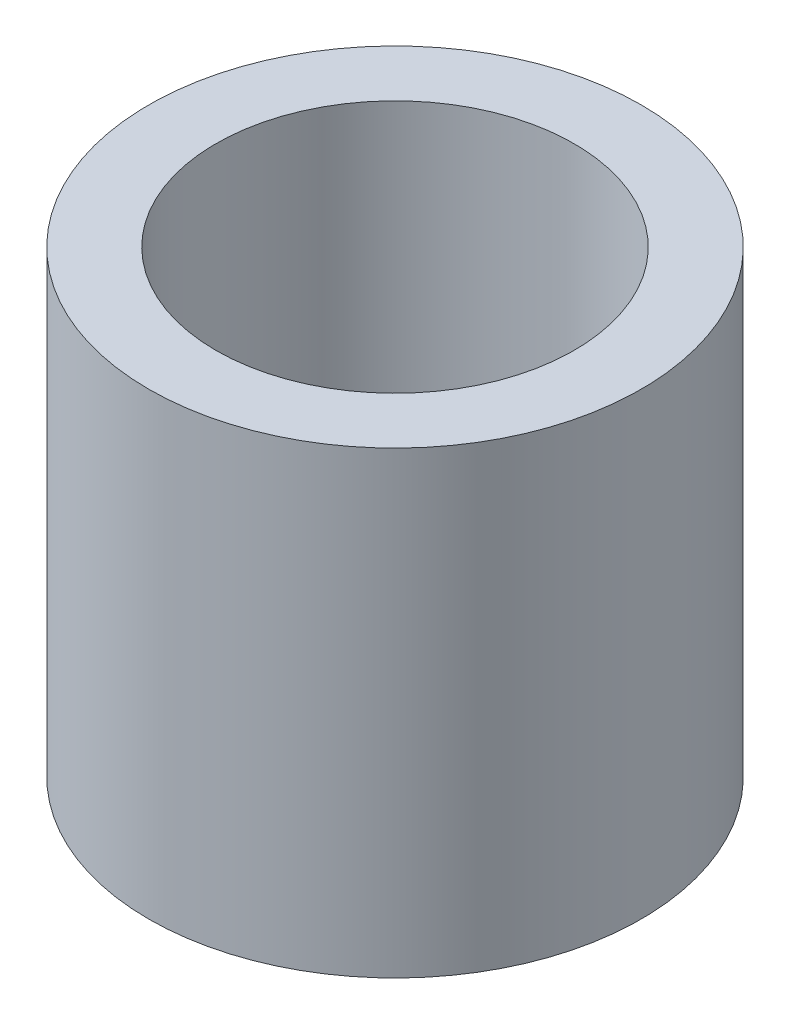
ISO-10303-21;
HEADER;
FILE_DESCRIPTION(('STEP AP214'),'2;1');
FILE_NAME('part.step','',(''),(''),'','','');
FILE_SCHEMA(('AUTOMOTIVE_DESIGN { 1 0 10303 214 1 1 1 1 }'));
ENDSEC;
DATA;
#1=APPLICATION_CONTEXT('core data for automotive mechanical design processes');
#2=APPLICATION_PROTOCOL_DEFINITION('international standard','automotive_design',2000,#1);
#3=PRODUCT_CONTEXT('',#1,'mechanical');
#4=PRODUCT('Part','Part','',(#3));
#5=PRODUCT_RELATED_PRODUCT_CATEGORY('part','',(#4));
#6=PRODUCT_DEFINITION_FORMATION('','',#4);
#7=PRODUCT_DEFINITION_CONTEXT('part definition',#1,'design');
#8=PRODUCT_DEFINITION('design','',#6,#7);
#9=PRODUCT_DEFINITION_SHAPE('','',#8);
#10=(LENGTH_UNIT() NAMED_UNIT(*) SI_UNIT(.MILLI.,.METRE.));
#11=(NAMED_UNIT(*) PLANE_ANGLE_UNIT() SI_UNIT($,.RADIAN.));
#12=(NAMED_UNIT(*) SI_UNIT($,.STERADIAN.) SOLID_ANGLE_UNIT());
#13=UNCERTAINTY_MEASURE_WITH_UNIT(LENGTH_MEASURE(1.E-05),#10,'distance_accuracy_value','');
#14=(GEOMETRIC_REPRESENTATION_CONTEXT(3) GLOBAL_UNCERTAINTY_ASSIGNED_CONTEXT((#13)) GLOBAL_UNIT_ASSIGNED_CONTEXT((#10,
#11,#12)) REPRESENTATION_CONTEXT('',''));
#15=CARTESIAN_POINT('',(0.,0.,0.));
#16=DIRECTION('',(0.,0.,1.));
#17=DIRECTION('',(1.,0.,0.));
#18=AXIS2_PLACEMENT_3D('',#15,#16,#17);
#19=CARTESIAN_POINT('',(0.,5.125,0.));
#20=DIRECTION('',(0.,1.,0.));
#21=DIRECTION('',(0.,0.,1.));
#22=AXIS2_PLACEMENT_3D('',#19,#20,#21);
#23=PLANE('',#22);
#24=CARTESIAN_POINT('',(0.,5.125,0.));
#25=DIRECTION('',(0.,1.,0.));
#26=DIRECTION('',(0.,0.,1.));
#27=AXIS2_PLACEMENT_3D('',#24,#25,#26);
#28=CIRCLE('',#27,5.5);
#29=CARTESIAN_POINT('',(0.,5.125,5.5));
#30=VERTEX_POINT('',#29);
#31=EDGE_CURVE('E10',#30,#30,#28,.T.);
#32=ORIENTED_EDGE('',*,*,#31,.T.);
#33=EDGE_LOOP('',(#32));
#34=FACE_BOUND('',#33,.T.);
#35=CARTESIAN_POINT('',(0.,5.125,0.));
#36=DIRECTION('',(0.,1.,0.));
#37=DIRECTION('',(0.,0.,1.));
#38=AXIS2_PLACEMENT_3D('',#35,#36,#37);
#39=CIRCLE('',#38,4.);
#40=CARTESIAN_POINT('',(0.,5.125,4.));
#41=VERTEX_POINT('',#40);
#42=EDGE_CURVE('E44',#41,#41,#39,.T.);
#43=ORIENTED_EDGE('',*,*,#42,.F.);
#44=EDGE_LOOP('',(#43));
#45=FACE_BOUND('',#44,.T.);
#46=ADVANCED_FACE('F33',(#34,#45),#23,.T.);
#47=CARTESIAN_POINT('',(0.,-5.125,0.));
#48=DIRECTION('',(0.,1.,0.));
#49=DIRECTION('',(0.,0.,1.));
#50=AXIS2_PLACEMENT_3D('',#47,#48,#49);
#51=PLANE('',#50);
#52=CARTESIAN_POINT('',(0.,-5.125,0.));
#53=DIRECTION('',(0.,1.,0.));
#54=DIRECTION('',(0.,0.,1.));
#55=AXIS2_PLACEMENT_3D('',#52,#53,#54);
#56=CIRCLE('',#55,5.5);
#57=CARTESIAN_POINT('',(0.,-5.125,5.5));
#58=VERTEX_POINT('',#57);
#59=EDGE_CURVE('E37',#58,#58,#56,.T.);
#60=ORIENTED_EDGE('',*,*,#59,.F.);
#61=EDGE_LOOP('',(#60));
#62=FACE_BOUND('',#61,.T.);
#63=CARTESIAN_POINT('',(0.,-5.125,0.));
#64=DIRECTION('',(0.,1.,0.));
#65=DIRECTION('',(0.,0.,1.));
#66=AXIS2_PLACEMENT_3D('',#63,#64,#65);
#67=CIRCLE('',#66,4.);
#68=CARTESIAN_POINT('',(0.,-5.125,4.));
#69=VERTEX_POINT('',#68);
#70=EDGE_CURVE('E46',#69,#69,#67,.T.);
#71=ORIENTED_EDGE('',*,*,#70,.T.);
#72=EDGE_LOOP('',(#71));
#73=FACE_BOUND('',#72,.T.);
#74=ADVANCED_FACE('F56',(#62,#73),#51,.F.);
#75=CARTESIAN_POINT('',(0.,5.125,0.));
#76=DIRECTION('',(0.,-1.,0.));
#77=DIRECTION('',(0.,0.,-1.));
#78=AXIS2_PLACEMENT_3D('',#75,#76,#77);
#79=CYLINDRICAL_SURFACE('',#78,5.5);
#80=ORIENTED_EDGE('',*,*,#31,.F.);
#81=EDGE_LOOP('',(#80));
#82=FACE_BOUND('',#81,.T.);
#83=ORIENTED_EDGE('',*,*,#59,.T.);
#84=EDGE_LOOP('',(#83));
#85=FACE_BOUND('',#84,.T.);
#86=ADVANCED_FACE('F35',(#82,#85),#79,.T.);
#87=CARTESIAN_POINT('',(0.,5.125,0.));
#88=DIRECTION('',(0.,-1.,0.));
#89=DIRECTION('',(0.,0.,-1.));
#90=AXIS2_PLACEMENT_3D('',#87,#88,#89);
#91=CYLINDRICAL_SURFACE('',#90,4.);
#92=ORIENTED_EDGE('',*,*,#42,.T.);
#93=EDGE_LOOP('',(#92));
#94=FACE_BOUND('',#93,.T.);
#95=ORIENTED_EDGE('',*,*,#70,.F.);
#96=EDGE_LOOP('',(#95));
#97=FACE_BOUND('',#96,.T.);
#98=ADVANCED_FACE('F52',(#94,#97),#91,.F.);
#99=CLOSED_SHELL('',(#46,#74,#86,#98));
#100=MANIFOLD_SOLID_BREP('B2',#99);
#101=ADVANCED_BREP_SHAPE_REPRESENTATION('',(#18,#100),#14);
#102=SHAPE_DEFINITION_REPRESENTATION(#9,#101);
ENDSEC;
END-ISO-10303-21;
